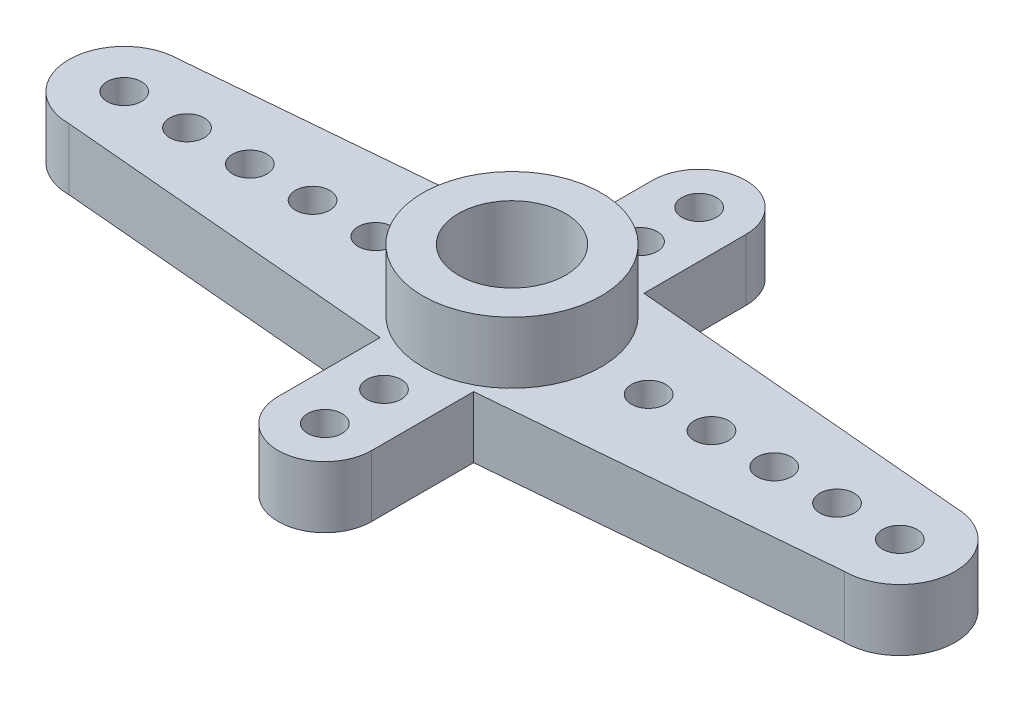
ISO-10303-21;
HEADER;
FILE_DESCRIPTION(('STEP AP214'),'2;1');
FILE_NAME('part.step','',(''),(''),'','','');
FILE_SCHEMA(('AUTOMOTIVE_DESIGN { 1 0 10303 214 1 1 1 1 }'));
ENDSEC;
DATA;
#1=APPLICATION_CONTEXT('core data for automotive mechanical design processes');
#2=APPLICATION_PROTOCOL_DEFINITION('international standard','automotive_design',2000,#1);
#3=PRODUCT_CONTEXT('',#1,'mechanical');
#4=PRODUCT('Part','Part','',(#3));
#5=PRODUCT_RELATED_PRODUCT_CATEGORY('part','',(#4));
#6=PRODUCT_DEFINITION_FORMATION('','',#4);
#7=PRODUCT_DEFINITION_CONTEXT('part definition',#1,'design');
#8=PRODUCT_DEFINITION('design','',#6,#7);
#9=PRODUCT_DEFINITION_SHAPE('','',#8);
#10=(LENGTH_UNIT() NAMED_UNIT(*) SI_UNIT(.MILLI.,.METRE.));
#11=(NAMED_UNIT(*) PLANE_ANGLE_UNIT() SI_UNIT($,.RADIAN.));
#12=(NAMED_UNIT(*) SI_UNIT($,.STERADIAN.) SOLID_ANGLE_UNIT());
#13=UNCERTAINTY_MEASURE_WITH_UNIT(LENGTH_MEASURE(1.E-05),#10,'distance_accuracy_value','');
#14=(GEOMETRIC_REPRESENTATION_CONTEXT(3) GLOBAL_UNCERTAINTY_ASSIGNED_CONTEXT((#13)) GLOBAL_UNIT_ASSIGNED_CONTEXT((#10,
#11,#12)) REPRESENTATION_CONTEXT('',''));
#15=CARTESIAN_POINT('',(0.,0.,0.));
#16=DIRECTION('',(0.,0.,1.));
#17=DIRECTION('',(1.,0.,0.));
#18=AXIS2_PLACEMENT_3D('',#15,#16,#17);
#19=CARTESIAN_POINT('',(18.,2.5,-7.6));
#20=DIRECTION('',(0.,1.,0.));
#21=DIRECTION('',(0.,0.,1.));
#22=AXIS2_PLACEMENT_3D('',#19,#20,#21);
#23=PLANE('',#22);
#24=CARTESIAN_POINT('',(18.,2.5,0.));
#25=DIRECTION('',(0.,1.,0.));
#26=DIRECTION('',(0.,0.,1.));
#27=AXIS2_PLACEMENT_3D('',#24,#25,#26);
#28=CIRCLE('',#27,3.625);
#29=CARTESIAN_POINT('',(18.,2.5,3.625));
#30=VERTEX_POINT('',#29);
#31=EDGE_CURVE('E360',#30,#30,#28,.T.);
#32=ORIENTED_EDGE('',*,*,#31,.F.);
#33=EDGE_LOOP('',(#32));
#34=FACE_BOUND('',#33,.T.);
#35=CARTESIAN_POINT('',(18.,2.5,-5.2));
#36=DIRECTION('',(0.,1.,0.));
#37=DIRECTION('',(0.,0.,1.));
#38=AXIS2_PLACEMENT_3D('',#35,#36,#37);
#39=CIRCLE('',#38,0.700000000000002);
#40=CARTESIAN_POINT('',(18.,2.5,-4.5));
#41=VERTEX_POINT('',#40);
#42=EDGE_CURVE('E374',#41,#41,#39,.T.);
#43=ORIENTED_EDGE('',*,*,#42,.F.);
#44=EDGE_LOOP('',(#43));
#45=FACE_BOUND('',#44,.T.);
#46=CARTESIAN_POINT('',(4.8,2.5,0.));
#47=DIRECTION('',(0.,1.,0.));
#48=DIRECTION('',(0.,0.,1.));
#49=AXIS2_PLACEMENT_3D('',#46,#47,#48);
#50=CIRCLE('',#49,0.7);
#51=CARTESIAN_POINT('',(4.8,2.5,0.7));
#52=VERTEX_POINT('',#51);
#53=EDGE_CURVE('E386',#52,#52,#50,.T.);
#54=ORIENTED_EDGE('',*,*,#53,.F.);
#55=EDGE_LOOP('',(#54));
#56=FACE_BOUND('',#55,.T.);
#57=CARTESIAN_POINT('',(9.9,2.5,0.));
#58=DIRECTION('',(0.,1.,0.));
#59=DIRECTION('',(0.,0.,1.));
#60=AXIS2_PLACEMENT_3D('',#57,#58,#59);
#61=CIRCLE('',#60,0.700000000000001);
#62=CARTESIAN_POINT('',(9.9,2.5,0.700000000000001));
#63=VERTEX_POINT('',#62);
#64=EDGE_CURVE('E398',#63,#63,#61,.T.);
#65=ORIENTED_EDGE('',*,*,#64,.F.);
#66=EDGE_LOOP('',(#65));
#67=FACE_BOUND('',#66,.T.);
#68=CARTESIAN_POINT('',(18.,2.5,5.2));
#69=DIRECTION('',(0.,1.,0.));
#70=DIRECTION('',(0.,0.,1.));
#71=AXIS2_PLACEMENT_3D('',#68,#69,#70);
#72=CIRCLE('',#71,0.700000000000002);
#73=CARTESIAN_POINT('',(18.,2.5,5.9));
#74=VERTEX_POINT('',#73);
#75=EDGE_CURVE('E410',#74,#74,#72,.T.);
#76=ORIENTED_EDGE('',*,*,#75,.F.);
#77=EDGE_LOOP('',(#76));
#78=FACE_BOUND('',#77,.T.);
#79=CARTESIAN_POINT('',(23.55,2.5,0.));
#80=DIRECTION('',(0.,1.,0.));
#81=DIRECTION('',(0.,0.,1.));
#82=AXIS2_PLACEMENT_3D('',#79,#80,#81);
#83=CIRCLE('',#82,0.700000000000002);
#84=CARTESIAN_POINT('',(23.55,2.5,0.700000000000002));
#85=VERTEX_POINT('',#84);
#86=EDGE_CURVE('E422',#85,#85,#83,.T.);
#87=ORIENTED_EDGE('',*,*,#86,.F.);
#88=EDGE_LOOP('',(#87));
#89=FACE_BOUND('',#88,.T.);
#90=CARTESIAN_POINT('',(28.65,2.5,0.));
#91=DIRECTION('',(0.,1.,0.));
#92=DIRECTION('',(0.,0.,1.));
#93=AXIS2_PLACEMENT_3D('',#90,#91,#92);
#94=CIRCLE('',#93,0.699999999999998);
#95=CARTESIAN_POINT('',(28.65,2.5,0.699999999999998));
#96=VERTEX_POINT('',#95);
#97=EDGE_CURVE('E434',#96,#96,#94,.T.);
#98=ORIENTED_EDGE('',*,*,#97,.F.);
#99=EDGE_LOOP('',(#98));
#100=FACE_BOUND('',#99,.T.);
#101=CARTESIAN_POINT('',(33.75,2.5,0.));
#102=DIRECTION('',(0.,1.,0.));
#103=DIRECTION('',(0.,0.,1.));
#104=AXIS2_PLACEMENT_3D('',#101,#102,#103);
#105=CIRCLE('',#104,0.700000000000001);
#106=CARTESIAN_POINT('',(33.75,2.5,0.700000000000001));
#107=VERTEX_POINT('',#106);
#108=EDGE_CURVE('E163',#107,#107,#105,.T.);
#109=ORIENTED_EDGE('',*,*,#108,.F.);
#110=EDGE_LOOP('',(#109));
#111=FACE_BOUND('',#110,.T.);
#112=CARTESIAN_POINT('',(18.,2.5,-7.6));
#113=DIRECTION('',(0.,1.,0.));
#114=DIRECTION('',(0.,0.,1.));
#115=AXIS2_PLACEMENT_3D('',#112,#113,#114);
#116=CIRCLE('',#115,1.9);
#117=CARTESIAN_POINT('',(19.9,2.5,-7.6));
#118=VERTEX_POINT('',#117);
#119=CARTESIAN_POINT('',(16.1,2.5,-7.6));
#120=VERTEX_POINT('',#119);
#121=EDGE_CURVE('E182',#118,#120,#116,.T.);
#122=ORIENTED_EDGE('',*,*,#121,.T.);
#123=DIRECTION('',(0.,0.,1.));
#124=VECTOR('',#123,1.);
#125=CARTESIAN_POINT('',(16.1,2.5,-7.6));
#126=LINE('',#125,#124);
#127=CARTESIAN_POINT('',(16.1,2.5,-3.45912698412698));
#128=VERTEX_POINT('',#127);
#129=EDGE_CURVE('E110',#120,#128,#126,.T.);
#130=ORIENTED_EDGE('',*,*,#129,.T.);
#131=DIRECTION('',(-0.996210862099652,0.,0.0869707895483823));
#132=VECTOR('',#131,1.);
#133=CARTESIAN_POINT('',(2.25,2.5,-2.25));
#134=LINE('',#133,#132);
#135=CARTESIAN_POINT('',(2.25,2.5,-2.25));
#136=VERTEX_POINT('',#135);
#137=EDGE_CURVE('E209',#128,#136,#134,.T.);
#138=ORIENTED_EDGE('',*,*,#137,.T.);
#139=CARTESIAN_POINT('',(2.25,2.5,0.));
#140=DIRECTION('',(0.,1.,0.));
#141=DIRECTION('',(0.,0.,1.));
#142=AXIS2_PLACEMENT_3D('',#139,#140,#141);
#143=CIRCLE('',#142,2.25);
#144=CARTESIAN_POINT('',(2.25,2.5,2.25));
#145=VERTEX_POINT('',#144);
#146=EDGE_CURVE('E228',#136,#145,#143,.T.);
#147=ORIENTED_EDGE('',*,*,#146,.T.);
#148=DIRECTION('',(0.996210862099651,0.,0.0869707895483823));
#149=VECTOR('',#148,1.);
#150=CARTESIAN_POINT('',(2.25,2.5,2.25));
#151=LINE('',#150,#149);
#152=CARTESIAN_POINT('',(16.1,2.5,3.45912698412698));
#153=VERTEX_POINT('',#152);
#154=EDGE_CURVE('E225',#145,#153,#151,.T.);
#155=ORIENTED_EDGE('',*,*,#154,.T.);
#156=DIRECTION('',(0.,0.,1.));
#157=VECTOR('',#156,1.);
#158=CARTESIAN_POINT('',(16.1,2.5,7.6));
#159=LINE('',#158,#157);
#160=CARTESIAN_POINT('',(16.1,2.5,7.6));
#161=VERTEX_POINT('',#160);
#162=EDGE_CURVE('E227',#153,#161,#159,.T.);
#163=ORIENTED_EDGE('',*,*,#162,.T.);
#164=CARTESIAN_POINT('',(18.,2.5,7.6));
#165=DIRECTION('',(0.,1.,0.));
#166=DIRECTION('',(0.,0.,1.));
#167=AXIS2_PLACEMENT_3D('',#164,#165,#166);
#168=CIRCLE('',#167,1.9);
#169=CARTESIAN_POINT('',(19.9,2.5,7.6));
#170=VERTEX_POINT('',#169);
#171=EDGE_CURVE('E230',#161,#170,#168,.T.);
#172=ORIENTED_EDGE('',*,*,#171,.T.);
#173=DIRECTION('',(0.,0.,-1.));
#174=VECTOR('',#173,1.);
#175=CARTESIAN_POINT('',(19.9,2.5,7.6));
#176=LINE('',#175,#174);
#177=CARTESIAN_POINT('',(19.9,2.5,3.45912698412698));
#178=VERTEX_POINT('',#177);
#179=EDGE_CURVE('E236',#170,#178,#176,.T.);
#180=ORIENTED_EDGE('',*,*,#179,.T.);
#181=DIRECTION('',(0.996210862099652,0.,-0.0869707895483824));
#182=VECTOR('',#181,1.);
#183=CARTESIAN_POINT('',(33.75,2.5,2.25));
#184=LINE('',#183,#182);
#185=CARTESIAN_POINT('',(33.75,2.5,2.25));
#186=VERTEX_POINT('',#185);
#187=EDGE_CURVE('E141',#178,#186,#184,.T.);
#188=ORIENTED_EDGE('',*,*,#187,.T.);
#189=CARTESIAN_POINT('',(33.75,2.5,0.));
#190=DIRECTION('',(0.,1.,0.));
#191=DIRECTION('',(0.,0.,1.));
#192=AXIS2_PLACEMENT_3D('',#189,#190,#191);
#193=CIRCLE('',#192,2.25);
#194=CARTESIAN_POINT('',(33.75,2.5,-2.25));
#195=VERTEX_POINT('',#194);
#196=EDGE_CURVE('E135',#186,#195,#193,.T.);
#197=ORIENTED_EDGE('',*,*,#196,.T.);
#198=DIRECTION('',(-0.996210862099652,0.,-0.0869707895483824));
#199=VECTOR('',#198,1.);
#200=CARTESIAN_POINT('',(33.75,2.5,-2.25));
#201=LINE('',#200,#199);
#202=CARTESIAN_POINT('',(19.9,2.5,-3.45912698412698));
#203=VERTEX_POINT('',#202);
#204=EDGE_CURVE('E139',#195,#203,#201,.T.);
#205=ORIENTED_EDGE('',*,*,#204,.T.);
#206=DIRECTION('',(0.,0.,-1.));
#207=VECTOR('',#206,1.);
#208=CARTESIAN_POINT('',(19.9,2.5,-7.6));
#209=LINE('',#208,#207);
#210=EDGE_CURVE('E55',#203,#118,#209,.T.);
#211=ORIENTED_EDGE('',*,*,#210,.T.);
#212=EDGE_LOOP('',(#122,#130,#138,#147,#155,#163,#172,#180,#188,#197,#205,#211));
#213=FACE_BOUND('',#212,.T.);
#214=CARTESIAN_POINT('',(31.2,2.5,0.));
#215=DIRECTION('',(0.,1.,0.));
#216=DIRECTION('',(0.,0.,1.));
#217=AXIS2_PLACEMENT_3D('',#214,#215,#216);
#218=CIRCLE('',#217,0.700000000000002);
#219=CARTESIAN_POINT('',(31.2,2.5,0.700000000000002));
#220=VERTEX_POINT('',#219);
#221=EDGE_CURVE('E440',#220,#220,#218,.T.);
#222=ORIENTED_EDGE('',*,*,#221,.F.);
#223=EDGE_LOOP('',(#222));
#224=FACE_BOUND('',#223,.T.);
#225=CARTESIAN_POINT('',(26.1,2.5,0.));
#226=DIRECTION('',(0.,1.,0.));
#227=DIRECTION('',(0.,0.,1.));
#228=AXIS2_PLACEMENT_3D('',#225,#226,#227);
#229=CIRCLE('',#228,0.700000000000002);
#230=CARTESIAN_POINT('',(26.1,2.5,0.700000000000002));
#231=VERTEX_POINT('',#230);
#232=EDGE_CURVE('E428',#231,#231,#229,.T.);
#233=ORIENTED_EDGE('',*,*,#232,.F.);
#234=EDGE_LOOP('',(#233));
#235=FACE_BOUND('',#234,.T.);
#236=CARTESIAN_POINT('',(18.,2.5,7.6));
#237=DIRECTION('',(0.,1.,0.));
#238=DIRECTION('',(0.,0.,1.));
#239=AXIS2_PLACEMENT_3D('',#236,#237,#238);
#240=CIRCLE('',#239,0.699999999999998);
#241=CARTESIAN_POINT('',(18.,2.5,8.3));
#242=VERTEX_POINT('',#241);
#243=EDGE_CURVE('E416',#242,#242,#240,.T.);
#244=ORIENTED_EDGE('',*,*,#243,.F.);
#245=EDGE_LOOP('',(#244));
#246=FACE_BOUND('',#245,.T.);
#247=CARTESIAN_POINT('',(12.45,2.5,0.));
#248=DIRECTION('',(0.,1.,0.));
#249=DIRECTION('',(0.,0.,1.));
#250=AXIS2_PLACEMENT_3D('',#247,#248,#249);
#251=CIRCLE('',#250,0.700000000000001);
#252=CARTESIAN_POINT('',(12.45,2.5,0.700000000000002));
#253=VERTEX_POINT('',#252);
#254=EDGE_CURVE('E404',#253,#253,#251,.T.);
#255=ORIENTED_EDGE('',*,*,#254,.F.);
#256=EDGE_LOOP('',(#255));
#257=FACE_BOUND('',#256,.T.);
#258=CARTESIAN_POINT('',(7.35,2.5,0.));
#259=DIRECTION('',(0.,1.,0.));
#260=DIRECTION('',(0.,0.,1.));
#261=AXIS2_PLACEMENT_3D('',#258,#259,#260);
#262=CIRCLE('',#261,0.7);
#263=CARTESIAN_POINT('',(7.35,2.5,0.7));
#264=VERTEX_POINT('',#263);
#265=EDGE_CURVE('E392',#264,#264,#262,.T.);
#266=ORIENTED_EDGE('',*,*,#265,.F.);
#267=EDGE_LOOP('',(#266));
#268=FACE_BOUND('',#267,.T.);
#269=CARTESIAN_POINT('',(2.25,2.5,0.));
#270=DIRECTION('',(0.,1.,0.));
#271=DIRECTION('',(0.,0.,1.));
#272=AXIS2_PLACEMENT_3D('',#269,#270,#271);
#273=CIRCLE('',#272,0.700000000000001);
#274=CARTESIAN_POINT('',(2.25,2.5,0.700000000000001));
#275=VERTEX_POINT('',#274);
#276=EDGE_CURVE('E380',#275,#275,#273,.T.);
#277=ORIENTED_EDGE('',*,*,#276,.F.);
#278=EDGE_LOOP('',(#277));
#279=FACE_BOUND('',#278,.T.);
#280=CARTESIAN_POINT('',(18.,2.5,-7.6));
#281=DIRECTION('',(0.,1.,0.));
#282=DIRECTION('',(0.,0.,1.));
#283=AXIS2_PLACEMENT_3D('',#280,#281,#282);
#284=CIRCLE('',#283,0.699999999999998);
#285=CARTESIAN_POINT('',(18.,2.5,-6.9));
#286=VERTEX_POINT('',#285);
#287=EDGE_CURVE('E368',#286,#286,#284,.T.);
#288=ORIENTED_EDGE('',*,*,#287,.F.);
#289=EDGE_LOOP('',(#288));
#290=FACE_BOUND('',#289,.T.);
#291=ADVANCED_FACE('F38',(#34,#45,#56,#67,#78,#89,#100,#111,#213,#224,#235,#246,#257,#268,#279,
#290),#23,.T.);
#292=CARTESIAN_POINT('',(18.,0.,-7.6));
#293=DIRECTION('',(0.,1.,0.));
#294=DIRECTION('',(0.,0.,1.));
#295=AXIS2_PLACEMENT_3D('',#292,#293,#294);
#296=PLANE('',#295);
#297=CARTESIAN_POINT('',(18.,0.,0.));
#298=DIRECTION('',(0.,1.,0.));
#299=DIRECTION('',(0.,0.,1.));
#300=AXIS2_PLACEMENT_3D('',#297,#298,#299);
#301=CIRCLE('',#300,1.25);
#302=CARTESIAN_POINT('',(18.,0.,1.25));
#303=VERTEX_POINT('',#302);
#304=EDGE_CURVE('E351',#303,#303,#301,.F.);
#305=ORIENTED_EDGE('',*,*,#304,.F.);
#306=EDGE_LOOP('',(#305));
#307=FACE_BOUND('',#306,.T.);
#308=CARTESIAN_POINT('',(18.,0.,-7.6));
#309=DIRECTION('',(0.,1.,0.));
#310=DIRECTION('',(0.,0.,1.));
#311=AXIS2_PLACEMENT_3D('',#308,#309,#310);
#312=CIRCLE('',#311,1.9);
#313=CARTESIAN_POINT('',(19.9,0.,-7.6));
#314=VERTEX_POINT('',#313);
#315=CARTESIAN_POINT('',(16.1,0.,-7.6));
#316=VERTEX_POINT('',#315);
#317=EDGE_CURVE('E159',#314,#316,#312,.T.);
#318=ORIENTED_EDGE('',*,*,#317,.F.);
#319=DIRECTION('',(0.,0.,-1.));
#320=VECTOR('',#319,1.);
#321=CARTESIAN_POINT('',(19.9,0.,-7.6));
#322=LINE('',#321,#320);
#323=CARTESIAN_POINT('',(19.9,0.,-3.45912698412698));
#324=VERTEX_POINT('',#323);
#325=EDGE_CURVE('E102',#324,#314,#322,.T.);
#326=ORIENTED_EDGE('',*,*,#325,.F.);
#327=DIRECTION('',(-0.996210862099652,0.,-0.0869707895483824));
#328=VECTOR('',#327,1.);
#329=CARTESIAN_POINT('',(33.75,0.,-2.25));
#330=LINE('',#329,#328);
#331=CARTESIAN_POINT('',(33.75,0.,-2.25));
#332=VERTEX_POINT('',#331);
#333=EDGE_CURVE('E96',#332,#324,#330,.T.);
#334=ORIENTED_EDGE('',*,*,#333,.F.);
#335=CARTESIAN_POINT('',(33.75,0.,0.));
#336=DIRECTION('',(0.,1.,0.));
#337=DIRECTION('',(0.,0.,1.));
#338=AXIS2_PLACEMENT_3D('',#335,#336,#337);
#339=CIRCLE('',#338,2.25);
#340=CARTESIAN_POINT('',(33.75,0.,2.25));
#341=VERTEX_POINT('',#340);
#342=EDGE_CURVE('E149',#341,#332,#339,.T.);
#343=ORIENTED_EDGE('',*,*,#342,.F.);
#344=DIRECTION('',(0.996210862099652,0.,-0.0869707895483824));
#345=VECTOR('',#344,1.);
#346=CARTESIAN_POINT('',(33.75,0.,2.25));
#347=LINE('',#346,#345);
#348=CARTESIAN_POINT('',(19.9,0.,3.45912698412698));
#349=VERTEX_POINT('',#348);
#350=EDGE_CURVE('E177',#349,#341,#347,.T.);
#351=ORIENTED_EDGE('',*,*,#350,.F.);
#352=DIRECTION('',(0.,0.,-1.));
#353=VECTOR('',#352,1.);
#354=CARTESIAN_POINT('',(19.9,0.,7.6));
#355=LINE('',#354,#353);
#356=CARTESIAN_POINT('',(19.9,0.,7.6));
#357=VERTEX_POINT('',#356);
#358=EDGE_CURVE('E175',#357,#349,#355,.T.);
#359=ORIENTED_EDGE('',*,*,#358,.F.);
#360=CARTESIAN_POINT('',(18.,0.,7.6));
#361=DIRECTION('',(0.,1.,0.));
#362=DIRECTION('',(0.,0.,1.));
#363=AXIS2_PLACEMENT_3D('',#360,#361,#362);
#364=CIRCLE('',#363,1.9);
#365=CARTESIAN_POINT('',(16.1,0.,7.6));
#366=VERTEX_POINT('',#365);
#367=EDGE_CURVE('E173',#366,#357,#364,.T.);
#368=ORIENTED_EDGE('',*,*,#367,.F.);
#369=DIRECTION('',(0.,0.,1.));
#370=VECTOR('',#369,1.);
#371=CARTESIAN_POINT('',(16.1,0.,7.6));
#372=LINE('',#371,#370);
#373=CARTESIAN_POINT('',(16.1,0.,3.45912698412698));
#374=VERTEX_POINT('',#373);
#375=EDGE_CURVE('E171',#374,#366,#372,.T.);
#376=ORIENTED_EDGE('',*,*,#375,.F.);
#377=DIRECTION('',(0.996210862099651,0.,0.0869707895483823));
#378=VECTOR('',#377,1.);
#379=CARTESIAN_POINT('',(2.25,0.,2.25));
#380=LINE('',#379,#378);
#381=CARTESIAN_POINT('',(2.25,0.,2.25));
#382=VERTEX_POINT('',#381);
#383=EDGE_CURVE('E169',#382,#374,#380,.T.);
#384=ORIENTED_EDGE('',*,*,#383,.F.);
#385=CARTESIAN_POINT('',(2.25,0.,0.));
#386=DIRECTION('',(0.,1.,0.));
#387=DIRECTION('',(0.,0.,1.));
#388=AXIS2_PLACEMENT_3D('',#385,#386,#387);
#389=CIRCLE('',#388,2.25);
#390=CARTESIAN_POINT('',(2.25,0.,-2.25));
#391=VERTEX_POINT('',#390);
#392=EDGE_CURVE('E167',#391,#382,#389,.T.);
#393=ORIENTED_EDGE('',*,*,#392,.F.);
#394=DIRECTION('',(-0.996210862099652,0.,0.0869707895483823));
#395=VECTOR('',#394,1.);
#396=CARTESIAN_POINT('',(2.25,0.,-2.25));
#397=LINE('',#396,#395);
#398=CARTESIAN_POINT('',(16.1,0.,-3.45912698412698));
#399=VERTEX_POINT('',#398);
#400=EDGE_CURVE('E165',#399,#391,#397,.T.);
#401=ORIENTED_EDGE('',*,*,#400,.F.);
#402=DIRECTION('',(0.,0.,1.));
#403=VECTOR('',#402,1.);
#404=CARTESIAN_POINT('',(16.1,0.,-7.6));
#405=LINE('',#404,#403);
#406=EDGE_CURVE('E162',#316,#399,#405,.T.);
#407=ORIENTED_EDGE('',*,*,#406,.F.);
#408=EDGE_LOOP('',(#318,#326,#334,#343,#351,#359,#368,#376,#384,#393,#401,#407));
#409=FACE_BOUND('',#408,.T.);
#410=CARTESIAN_POINT('',(33.75,0.,0.));
#411=DIRECTION('',(0.,1.,0.));
#412=DIRECTION('',(0.,0.,1.));
#413=AXIS2_PLACEMENT_3D('',#410,#411,#412);
#414=CIRCLE('',#413,0.700000000000001);
#415=CARTESIAN_POINT('',(33.75,0.,0.700000000000001));
#416=VERTEX_POINT('',#415);
#417=EDGE_CURVE('E443',#416,#416,#414,.T.);
#418=ORIENTED_EDGE('',*,*,#417,.T.);
#419=EDGE_LOOP('',(#418));
#420=FACE_BOUND('',#419,.T.);
#421=CARTESIAN_POINT('',(31.2,0.,0.));
#422=DIRECTION('',(0.,1.,0.));
#423=DIRECTION('',(0.,0.,1.));
#424=AXIS2_PLACEMENT_3D('',#421,#422,#423);
#425=CIRCLE('',#424,0.700000000000002);
#426=CARTESIAN_POINT('',(31.2,0.,0.700000000000002));
#427=VERTEX_POINT('',#426);
#428=EDGE_CURVE('E437',#427,#427,#425,.T.);
#429=ORIENTED_EDGE('',*,*,#428,.T.);
#430=EDGE_LOOP('',(#429));
#431=FACE_BOUND('',#430,.T.);
#432=CARTESIAN_POINT('',(28.65,0.,0.));
#433=DIRECTION('',(0.,1.,0.));
#434=DIRECTION('',(0.,0.,1.));
#435=AXIS2_PLACEMENT_3D('',#432,#433,#434);
#436=CIRCLE('',#435,0.699999999999998);
#437=CARTESIAN_POINT('',(28.65,0.,0.699999999999998));
#438=VERTEX_POINT('',#437);
#439=EDGE_CURVE('E431',#438,#438,#436,.T.);
#440=ORIENTED_EDGE('',*,*,#439,.T.);
#441=EDGE_LOOP('',(#440));
#442=FACE_BOUND('',#441,.T.);
#443=CARTESIAN_POINT('',(26.1,0.,0.));
#444=DIRECTION('',(0.,1.,0.));
#445=DIRECTION('',(0.,0.,1.));
#446=AXIS2_PLACEMENT_3D('',#443,#444,#445);
#447=CIRCLE('',#446,0.700000000000002);
#448=CARTESIAN_POINT('',(26.1,0.,0.700000000000002));
#449=VERTEX_POINT('',#448);
#450=EDGE_CURVE('E425',#449,#449,#447,.T.);
#451=ORIENTED_EDGE('',*,*,#450,.T.);
#452=EDGE_LOOP('',(#451));
#453=FACE_BOUND('',#452,.T.);
#454=CARTESIAN_POINT('',(23.55,0.,0.));
#455=DIRECTION('',(0.,1.,0.));
#456=DIRECTION('',(0.,0.,1.));
#457=AXIS2_PLACEMENT_3D('',#454,#455,#456);
#458=CIRCLE('',#457,0.700000000000002);
#459=CARTESIAN_POINT('',(23.55,0.,0.700000000000002));
#460=VERTEX_POINT('',#459);
#461=EDGE_CURVE('E419',#460,#460,#458,.T.);
#462=ORIENTED_EDGE('',*,*,#461,.T.);
#463=EDGE_LOOP('',(#462));
#464=FACE_BOUND('',#463,.T.);
#465=CARTESIAN_POINT('',(18.,0.,7.6));
#466=DIRECTION('',(0.,1.,0.));
#467=DIRECTION('',(0.,0.,1.));
#468=AXIS2_PLACEMENT_3D('',#465,#466,#467);
#469=CIRCLE('',#468,0.699999999999998);
#470=CARTESIAN_POINT('',(18.,0.,8.3));
#471=VERTEX_POINT('',#470);
#472=EDGE_CURVE('E413',#471,#471,#469,.T.);
#473=ORIENTED_EDGE('',*,*,#472,.T.);
#474=EDGE_LOOP('',(#473));
#475=FACE_BOUND('',#474,.T.);
#476=CARTESIAN_POINT('',(18.,0.,5.2));
#477=DIRECTION('',(0.,1.,0.));
#478=DIRECTION('',(0.,0.,1.));
#479=AXIS2_PLACEMENT_3D('',#476,#477,#478);
#480=CIRCLE('',#479,0.700000000000002);
#481=CARTESIAN_POINT('',(18.,0.,5.9));
#482=VERTEX_POINT('',#481);
#483=EDGE_CURVE('E407',#482,#482,#480,.T.);
#484=ORIENTED_EDGE('',*,*,#483,.T.);
#485=EDGE_LOOP('',(#484));
#486=FACE_BOUND('',#485,.T.);
#487=CARTESIAN_POINT('',(12.45,0.,0.));
#488=DIRECTION('',(0.,1.,0.));
#489=DIRECTION('',(0.,0.,1.));
#490=AXIS2_PLACEMENT_3D('',#487,#488,#489);
#491=CIRCLE('',#490,0.700000000000001);
#492=CARTESIAN_POINT('',(12.45,0.,0.700000000000002));
#493=VERTEX_POINT('',#492);
#494=EDGE_CURVE('E401',#493,#493,#491,.T.);
#495=ORIENTED_EDGE('',*,*,#494,.T.);
#496=EDGE_LOOP('',(#495));
#497=FACE_BOUND('',#496,.T.);
#498=CARTESIAN_POINT('',(9.9,0.,0.));
#499=DIRECTION('',(0.,1.,0.));
#500=DIRECTION('',(0.,0.,1.));
#501=AXIS2_PLACEMENT_3D('',#498,#499,#500);
#502=CIRCLE('',#501,0.700000000000001);
#503=CARTESIAN_POINT('',(9.9,0.,0.700000000000001));
#504=VERTEX_POINT('',#503);
#505=EDGE_CURVE('E395',#504,#504,#502,.T.);
#506=ORIENTED_EDGE('',*,*,#505,.T.);
#507=EDGE_LOOP('',(#506));
#508=FACE_BOUND('',#507,.T.);
#509=CARTESIAN_POINT('',(7.35,0.,0.));
#510=DIRECTION('',(0.,1.,0.));
#511=DIRECTION('',(0.,0.,1.));
#512=AXIS2_PLACEMENT_3D('',#509,#510,#511);
#513=CIRCLE('',#512,0.7);
#514=CARTESIAN_POINT('',(7.35,0.,0.7));
#515=VERTEX_POINT('',#514);
#516=EDGE_CURVE('E389',#515,#515,#513,.T.);
#517=ORIENTED_EDGE('',*,*,#516,.T.);
#518=EDGE_LOOP('',(#517));
#519=FACE_BOUND('',#518,.T.);
#520=CARTESIAN_POINT('',(4.8,0.,0.));
#521=DIRECTION('',(0.,1.,0.));
#522=DIRECTION('',(0.,0.,1.));
#523=AXIS2_PLACEMENT_3D('',#520,#521,#522);
#524=CIRCLE('',#523,0.7);
#525=CARTESIAN_POINT('',(4.8,0.,0.7));
#526=VERTEX_POINT('',#525);
#527=EDGE_CURVE('E383',#526,#526,#524,.T.);
#528=ORIENTED_EDGE('',*,*,#527,.T.);
#529=EDGE_LOOP('',(#528));
#530=FACE_BOUND('',#529,.T.);
#531=CARTESIAN_POINT('',(2.25,0.,0.));
#532=DIRECTION('',(0.,1.,0.));
#533=DIRECTION('',(0.,0.,1.));
#534=AXIS2_PLACEMENT_3D('',#531,#532,#533);
#535=CIRCLE('',#534,0.700000000000001);
#536=CARTESIAN_POINT('',(2.25,0.,0.700000000000001));
#537=VERTEX_POINT('',#536);
#538=EDGE_CURVE('E377',#537,#537,#535,.T.);
#539=ORIENTED_EDGE('',*,*,#538,.T.);
#540=EDGE_LOOP('',(#539));
#541=FACE_BOUND('',#540,.T.);
#542=CARTESIAN_POINT('',(18.,0.,-5.2));
#543=DIRECTION('',(0.,1.,0.));
#544=DIRECTION('',(0.,0.,1.));
#545=AXIS2_PLACEMENT_3D('',#542,#543,#544);
#546=CIRCLE('',#545,0.700000000000002);
#547=CARTESIAN_POINT('',(18.,0.,-4.5));
#548=VERTEX_POINT('',#547);
#549=EDGE_CURVE('E371',#548,#548,#546,.T.);
#550=ORIENTED_EDGE('',*,*,#549,.T.);
#551=EDGE_LOOP('',(#550));
#552=FACE_BOUND('',#551,.T.);
#553=CARTESIAN_POINT('',(18.,0.,-7.6));
#554=DIRECTION('',(0.,1.,0.));
#555=DIRECTION('',(0.,0.,1.));
#556=AXIS2_PLACEMENT_3D('',#553,#554,#555);
#557=CIRCLE('',#556,0.699999999999998);
#558=CARTESIAN_POINT('',(18.,0.,-6.9));
#559=VERTEX_POINT('',#558);
#560=EDGE_CURVE('E365',#559,#559,#557,.T.);
#561=ORIENTED_EDGE('',*,*,#560,.T.);
#562=EDGE_LOOP('',(#561));
#563=FACE_BOUND('',#562,.T.);
#564=ADVANCED_FACE('F213',(#307,#409,#420,#431,#442,#453,#464,#475,#486,#497,#508,#519,#530,
#541,#552,#563),#296,.F.);
#565=CARTESIAN_POINT('',(18.,2.5,-7.6));
#566=DIRECTION('',(0.,-1.,0.));
#567=DIRECTION('',(0.,0.,-1.));
#568=AXIS2_PLACEMENT_3D('',#565,#566,#567);
#569=CYLINDRICAL_SURFACE('',#568,1.9);
#570=ORIENTED_EDGE('',*,*,#317,.T.);
#571=DIRECTION('',(0.,-1.,0.));
#572=VECTOR('',#571,1.);
#573=CARTESIAN_POINT('',(16.1,2.5,-7.6));
#574=LINE('',#573,#572);
#575=EDGE_CURVE('E11',#120,#316,#574,.T.);
#576=ORIENTED_EDGE('',*,*,#575,.F.);
#577=ORIENTED_EDGE('',*,*,#121,.F.);
#578=DIRECTION('',(0.,-1.,0.));
#579=VECTOR('',#578,1.);
#580=CARTESIAN_POINT('',(19.9,2.5,-7.6));
#581=LINE('',#580,#579);
#582=EDGE_CURVE('E155',#118,#314,#581,.T.);
#583=ORIENTED_EDGE('',*,*,#582,.T.);
#584=EDGE_LOOP('',(#570,#576,#577,#583));
#585=FACE_BOUND('',#584,.T.);
#586=ADVANCED_FACE('F40',(#585),#569,.T.);
#587=CARTESIAN_POINT('',(16.1,2.5,-7.6));
#588=DIRECTION('',(1.,0.,0.));
#589=DIRECTION('',(0.,0.,-1.));
#590=AXIS2_PLACEMENT_3D('',#587,#588,#589);
#591=PLANE('',#590);
#592=ORIENTED_EDGE('',*,*,#406,.T.);
#593=DIRECTION('',(0.,-1.,0.));
#594=VECTOR('',#593,1.);
#595=CARTESIAN_POINT('',(16.1,2.5,-3.45912698412698));
#596=LINE('',#595,#594);
#597=EDGE_CURVE('E47',#128,#399,#596,.T.);
#598=ORIENTED_EDGE('',*,*,#597,.F.);
#599=ORIENTED_EDGE('',*,*,#129,.F.);
#600=ORIENTED_EDGE('',*,*,#575,.T.);
#601=EDGE_LOOP('',(#592,#598,#599,#600));
#602=FACE_BOUND('',#601,.T.);
#603=ADVANCED_FACE('F677',(#602),#591,.F.);
#604=CARTESIAN_POINT('',(2.25,2.5,-2.25));
#605=DIRECTION('',(0.0869707895483823,0.,0.996210862099651));
#606=DIRECTION('',(0.996210862099652,0.,-0.0869707895483823));
#607=AXIS2_PLACEMENT_3D('',#604,#605,#606);
#608=PLANE('',#607);
#609=ORIENTED_EDGE('',*,*,#400,.T.);
#610=DIRECTION('',(0.,-1.,0.));
#611=VECTOR('',#610,1.);
#612=CARTESIAN_POINT('',(2.25,2.5,-2.25));
#613=LINE('',#612,#611);
#614=EDGE_CURVE('E201',#136,#391,#613,.T.);
#615=ORIENTED_EDGE('',*,*,#614,.F.);
#616=ORIENTED_EDGE('',*,*,#137,.F.);
#617=ORIENTED_EDGE('',*,*,#597,.T.);
#618=EDGE_LOOP('',(#609,#615,#616,#617));
#619=FACE_BOUND('',#618,.T.);
#620=ADVANCED_FACE('F207',(#619),#608,.F.);
#621=CARTESIAN_POINT('',(2.25,2.5,0.));
#622=DIRECTION('',(0.,-1.,0.));
#623=DIRECTION('',(0.,0.,-1.));
#624=AXIS2_PLACEMENT_3D('',#621,#622,#623);
#625=CYLINDRICAL_SURFACE('',#624,2.25);
#626=ORIENTED_EDGE('',*,*,#392,.T.);
#627=DIRECTION('',(0.,-1.,0.));
#628=VECTOR('',#627,1.);
#629=CARTESIAN_POINT('',(2.25,2.5,2.25));
#630=LINE('',#629,#628);
#631=EDGE_CURVE('E198',#145,#382,#630,.T.);
#632=ORIENTED_EDGE('',*,*,#631,.F.);
#633=ORIENTED_EDGE('',*,*,#146,.F.);
#634=ORIENTED_EDGE('',*,*,#614,.T.);
#635=EDGE_LOOP('',(#626,#632,#633,#634));
#636=FACE_BOUND('',#635,.T.);
#637=ADVANCED_FACE('F219',(#636),#625,.T.);
#638=CARTESIAN_POINT('',(2.25,2.5,2.25));
#639=DIRECTION('',(0.0869707895483823,0.,-0.996210862099651));
#640=DIRECTION('',(-0.996210862099652,0.,-0.0869707895483823));
#641=AXIS2_PLACEMENT_3D('',#638,#639,#640);
#642=PLANE('',#641);
#643=ORIENTED_EDGE('',*,*,#383,.T.);
#644=DIRECTION('',(0.,-1.,0.));
#645=VECTOR('',#644,1.);
#646=CARTESIAN_POINT('',(16.1,2.5,3.45912698412698));
#647=LINE('',#646,#645);
#648=EDGE_CURVE('E195',#153,#374,#647,.T.);
#649=ORIENTED_EDGE('',*,*,#648,.F.);
#650=ORIENTED_EDGE('',*,*,#154,.F.);
#651=ORIENTED_EDGE('',*,*,#631,.T.);
#652=EDGE_LOOP('',(#643,#649,#650,#651));
#653=FACE_BOUND('',#652,.T.);
#654=ADVANCED_FACE('F223',(#653),#642,.F.);
#655=CARTESIAN_POINT('',(16.1,2.5,7.6));
#656=DIRECTION('',(1.,0.,0.));
#657=DIRECTION('',(0.,0.,-1.));
#658=AXIS2_PLACEMENT_3D('',#655,#656,#657);
#659=PLANE('',#658);
#660=ORIENTED_EDGE('',*,*,#375,.T.);
#661=DIRECTION('',(0.,-1.,0.));
#662=VECTOR('',#661,1.);
#663=CARTESIAN_POINT('',(16.1,2.5,7.6));
#664=LINE('',#663,#662);
#665=EDGE_CURVE('E192',#161,#366,#664,.T.);
#666=ORIENTED_EDGE('',*,*,#665,.F.);
#667=ORIENTED_EDGE('',*,*,#162,.F.);
#668=ORIENTED_EDGE('',*,*,#648,.T.);
#669=EDGE_LOOP('',(#660,#666,#667,#668));
#670=FACE_BOUND('',#669,.T.);
#671=ADVANCED_FACE('F642',(#670),#659,.F.);
#672=CARTESIAN_POINT('',(18.,2.5,7.6));
#673=DIRECTION('',(0.,-1.,0.));
#674=DIRECTION('',(0.,0.,-1.));
#675=AXIS2_PLACEMENT_3D('',#672,#673,#674);
#676=CYLINDRICAL_SURFACE('',#675,1.9);
#677=ORIENTED_EDGE('',*,*,#367,.T.);
#678=DIRECTION('',(0.,-1.,0.));
#679=VECTOR('',#678,1.);
#680=CARTESIAN_POINT('',(19.9,2.5,7.6));
#681=LINE('',#680,#679);
#682=EDGE_CURVE('E189',#170,#357,#681,.T.);
#683=ORIENTED_EDGE('',*,*,#682,.F.);
#684=ORIENTED_EDGE('',*,*,#171,.F.);
#685=ORIENTED_EDGE('',*,*,#665,.T.);
#686=EDGE_LOOP('',(#677,#683,#684,#685));
#687=FACE_BOUND('',#686,.T.);
#688=ADVANCED_FACE('F633',(#687),#676,.T.);
#689=CARTESIAN_POINT('',(19.9,2.5,7.6));
#690=DIRECTION('',(-1.,0.,0.));
#691=DIRECTION('',(0.,0.,1.));
#692=AXIS2_PLACEMENT_3D('',#689,#690,#691);
#693=PLANE('',#692);
#694=ORIENTED_EDGE('',*,*,#358,.T.);
#695=DIRECTION('',(0.,-1.,0.));
#696=VECTOR('',#695,1.);
#697=CARTESIAN_POINT('',(19.9,2.5,3.45912698412698));
#698=LINE('',#697,#696);
#699=EDGE_CURVE('E186',#178,#349,#698,.T.);
#700=ORIENTED_EDGE('',*,*,#699,.F.);
#701=ORIENTED_EDGE('',*,*,#179,.F.);
#702=ORIENTED_EDGE('',*,*,#682,.T.);
#703=EDGE_LOOP('',(#694,#700,#701,#702));
#704=FACE_BOUND('',#703,.T.);
#705=ADVANCED_FACE('F242',(#704),#693,.F.);
#706=CARTESIAN_POINT('',(33.75,2.5,2.25));
#707=DIRECTION('',(-0.0869707895483824,0.,-0.996210862099651));
#708=DIRECTION('',(-0.996210862099652,0.,0.0869707895483824));
#709=AXIS2_PLACEMENT_3D('',#706,#707,#708);
#710=PLANE('',#709);
#711=ORIENTED_EDGE('',*,*,#350,.T.);
#712=DIRECTION('',(0.,-1.,0.));
#713=VECTOR('',#712,1.);
#714=CARTESIAN_POINT('',(33.75,2.5,2.25));
#715=LINE('',#714,#713);
#716=EDGE_CURVE('E150',#186,#341,#715,.T.);
#717=ORIENTED_EDGE('',*,*,#716,.F.);
#718=ORIENTED_EDGE('',*,*,#187,.F.);
#719=ORIENTED_EDGE('',*,*,#699,.T.);
#720=EDGE_LOOP('',(#711,#717,#718,#719));
#721=FACE_BOUND('',#720,.T.);
#722=ADVANCED_FACE('F246',(#721),#710,.F.);
#723=CARTESIAN_POINT('',(33.75,2.5,0.));
#724=DIRECTION('',(0.,-1.,0.));
#725=DIRECTION('',(0.,0.,-1.));
#726=AXIS2_PLACEMENT_3D('',#723,#724,#725);
#727=CYLINDRICAL_SURFACE('',#726,2.25);
#728=ORIENTED_EDGE('',*,*,#342,.T.);
#729=DIRECTION('',(0.,-1.,0.));
#730=VECTOR('',#729,1.);
#731=CARTESIAN_POINT('',(33.75,2.5,-2.25));
#732=LINE('',#731,#730);
#733=EDGE_CURVE('E146',#195,#332,#732,.T.);
#734=ORIENTED_EDGE('',*,*,#733,.F.);
#735=ORIENTED_EDGE('',*,*,#196,.F.);
#736=ORIENTED_EDGE('',*,*,#716,.T.);
#737=EDGE_LOOP('',(#728,#734,#735,#736));
#738=FACE_BOUND('',#737,.T.);
#739=ADVANCED_FACE('F147',(#738),#727,.T.);
#740=CARTESIAN_POINT('',(33.75,2.5,-2.25));
#741=DIRECTION('',(-0.0869707895483824,0.,0.996210862099651));
#742=DIRECTION('',(0.996210862099652,0.,0.0869707895483824));
#743=AXIS2_PLACEMENT_3D('',#740,#741,#742);
#744=PLANE('',#743);
#745=ORIENTED_EDGE('',*,*,#333,.T.);
#746=DIRECTION('',(0.,-1.,0.));
#747=VECTOR('',#746,1.);
#748=CARTESIAN_POINT('',(19.9,2.5,-3.45912698412698));
#749=LINE('',#748,#747);
#750=EDGE_CURVE('E151',#203,#324,#749,.T.);
#751=ORIENTED_EDGE('',*,*,#750,.F.);
#752=ORIENTED_EDGE('',*,*,#204,.F.);
#753=ORIENTED_EDGE('',*,*,#733,.T.);
#754=EDGE_LOOP('',(#745,#751,#752,#753));
#755=FACE_BOUND('',#754,.T.);
#756=ADVANCED_FACE('F153',(#755),#744,.F.);
#757=CARTESIAN_POINT('',(19.9,2.5,-7.6));
#758=DIRECTION('',(-1.,0.,0.));
#759=DIRECTION('',(0.,0.,1.));
#760=AXIS2_PLACEMENT_3D('',#757,#758,#759);
#761=PLANE('',#760);
#762=ORIENTED_EDGE('',*,*,#325,.T.);
#763=ORIENTED_EDGE('',*,*,#582,.F.);
#764=ORIENTED_EDGE('',*,*,#210,.F.);
#765=ORIENTED_EDGE('',*,*,#750,.T.);
#766=EDGE_LOOP('',(#762,#763,#764,#765));
#767=FACE_BOUND('',#766,.T.);
#768=ADVANCED_FACE('F250',(#767),#761,.F.);
#769=CARTESIAN_POINT('',(33.75,2.5,0.));
#770=DIRECTION('',(0.,-1.,0.));
#771=DIRECTION('',(0.,0.,-1.));
#772=AXIS2_PLACEMENT_3D('',#769,#770,#771);
#773=CYLINDRICAL_SURFACE('',#772,0.700000000000001);
#774=ORIENTED_EDGE('',*,*,#108,.T.);
#775=EDGE_LOOP('',(#774));
#776=FACE_BOUND('',#775,.T.);
#777=ORIENTED_EDGE('',*,*,#417,.F.);
#778=EDGE_LOOP('',(#777));
#779=FACE_BOUND('',#778,.T.);
#780=ADVANCED_FACE('F252',(#776,#779),#773,.F.);
#781=CARTESIAN_POINT('',(31.2,2.5,0.));
#782=DIRECTION('',(0.,-1.,0.));
#783=DIRECTION('',(0.,0.,-1.));
#784=AXIS2_PLACEMENT_3D('',#781,#782,#783);
#785=CYLINDRICAL_SURFACE('',#784,0.700000000000002);
#786=ORIENTED_EDGE('',*,*,#221,.T.);
#787=EDGE_LOOP('',(#786));
#788=FACE_BOUND('',#787,.T.);
#789=ORIENTED_EDGE('',*,*,#428,.F.);
#790=EDGE_LOOP('',(#789));
#791=FACE_BOUND('',#790,.T.);
#792=ADVANCED_FACE('F258',(#788,#791),#785,.F.);
#793=CARTESIAN_POINT('',(28.65,2.5,0.));
#794=DIRECTION('',(0.,-1.,0.));
#795=DIRECTION('',(0.,0.,-1.));
#796=AXIS2_PLACEMENT_3D('',#793,#794,#795);
#797=CYLINDRICAL_SURFACE('',#796,0.699999999999998);
#798=ORIENTED_EDGE('',*,*,#97,.T.);
#799=EDGE_LOOP('',(#798));
#800=FACE_BOUND('',#799,.T.);
#801=ORIENTED_EDGE('',*,*,#439,.F.);
#802=EDGE_LOOP('',(#801));
#803=FACE_BOUND('',#802,.T.);
#804=ADVANCED_FACE('F275',(#800,#803),#797,.F.);
#805=CARTESIAN_POINT('',(26.1,2.5,0.));
#806=DIRECTION('',(0.,-1.,0.));
#807=DIRECTION('',(0.,0.,-1.));
#808=AXIS2_PLACEMENT_3D('',#805,#806,#807);
#809=CYLINDRICAL_SURFACE('',#808,0.700000000000002);
#810=ORIENTED_EDGE('',*,*,#232,.T.);
#811=EDGE_LOOP('',(#810));
#812=FACE_BOUND('',#811,.T.);
#813=ORIENTED_EDGE('',*,*,#450,.F.);
#814=EDGE_LOOP('',(#813));
#815=FACE_BOUND('',#814,.T.);
#816=ADVANCED_FACE('F279',(#812,#815),#809,.F.);
#817=CARTESIAN_POINT('',(23.55,2.5,0.));
#818=DIRECTION('',(0.,-1.,0.));
#819=DIRECTION('',(0.,0.,-1.));
#820=AXIS2_PLACEMENT_3D('',#817,#818,#819);
#821=CYLINDRICAL_SURFACE('',#820,0.700000000000002);
#822=ORIENTED_EDGE('',*,*,#86,.T.);
#823=EDGE_LOOP('',(#822));
#824=FACE_BOUND('',#823,.T.);
#825=ORIENTED_EDGE('',*,*,#461,.F.);
#826=EDGE_LOOP('',(#825));
#827=FACE_BOUND('',#826,.T.);
#828=ADVANCED_FACE('F283',(#824,#827),#821,.F.);
#829=CARTESIAN_POINT('',(18.,2.5,7.6));
#830=DIRECTION('',(0.,-1.,0.));
#831=DIRECTION('',(0.,0.,-1.));
#832=AXIS2_PLACEMENT_3D('',#829,#830,#831);
#833=CYLINDRICAL_SURFACE('',#832,0.699999999999998);
#834=ORIENTED_EDGE('',*,*,#243,.T.);
#835=EDGE_LOOP('',(#834));
#836=FACE_BOUND('',#835,.T.);
#837=ORIENTED_EDGE('',*,*,#472,.F.);
#838=EDGE_LOOP('',(#837));
#839=FACE_BOUND('',#838,.T.);
#840=ADVANCED_FACE('F287',(#836,#839),#833,.F.);
#841=CARTESIAN_POINT('',(18.,2.5,5.2));
#842=DIRECTION('',(0.,-1.,0.));
#843=DIRECTION('',(0.,0.,-1.));
#844=AXIS2_PLACEMENT_3D('',#841,#842,#843);
#845=CYLINDRICAL_SURFACE('',#844,0.700000000000002);
#846=ORIENTED_EDGE('',*,*,#75,.T.);
#847=EDGE_LOOP('',(#846));
#848=FACE_BOUND('',#847,.T.);
#849=ORIENTED_EDGE('',*,*,#483,.F.);
#850=EDGE_LOOP('',(#849));
#851=FACE_BOUND('',#850,.T.);
#852=ADVANCED_FACE('F291',(#848,#851),#845,.F.);
#853=CARTESIAN_POINT('',(12.45,2.5,0.));
#854=DIRECTION('',(0.,-1.,0.));
#855=DIRECTION('',(0.,0.,-1.));
#856=AXIS2_PLACEMENT_3D('',#853,#854,#855);
#857=CYLINDRICAL_SURFACE('',#856,0.700000000000001);
#858=ORIENTED_EDGE('',*,*,#254,.T.);
#859=EDGE_LOOP('',(#858));
#860=FACE_BOUND('',#859,.T.);
#861=ORIENTED_EDGE('',*,*,#494,.F.);
#862=EDGE_LOOP('',(#861));
#863=FACE_BOUND('',#862,.T.);
#864=ADVANCED_FACE('F295',(#860,#863),#857,.F.);
#865=CARTESIAN_POINT('',(9.9,2.5,0.));
#866=DIRECTION('',(0.,-1.,0.));
#867=DIRECTION('',(0.,0.,-1.));
#868=AXIS2_PLACEMENT_3D('',#865,#866,#867);
#869=CYLINDRICAL_SURFACE('',#868,0.700000000000001);
#870=ORIENTED_EDGE('',*,*,#64,.T.);
#871=EDGE_LOOP('',(#870));
#872=FACE_BOUND('',#871,.T.);
#873=ORIENTED_EDGE('',*,*,#505,.F.);
#874=EDGE_LOOP('',(#873));
#875=FACE_BOUND('',#874,.T.);
#876=ADVANCED_FACE('F299',(#872,#875),#869,.F.);
#877=CARTESIAN_POINT('',(7.35,2.5,0.));
#878=DIRECTION('',(0.,-1.,0.));
#879=DIRECTION('',(0.,0.,-1.));
#880=AXIS2_PLACEMENT_3D('',#877,#878,#879);
#881=CYLINDRICAL_SURFACE('',#880,0.7);
#882=ORIENTED_EDGE('',*,*,#265,.T.);
#883=EDGE_LOOP('',(#882));
#884=FACE_BOUND('',#883,.T.);
#885=ORIENTED_EDGE('',*,*,#516,.F.);
#886=EDGE_LOOP('',(#885));
#887=FACE_BOUND('',#886,.T.);
#888=ADVANCED_FACE('F303',(#884,#887),#881,.F.);
#889=CARTESIAN_POINT('',(4.8,2.5,0.));
#890=DIRECTION('',(0.,-1.,0.));
#891=DIRECTION('',(0.,0.,-1.));
#892=AXIS2_PLACEMENT_3D('',#889,#890,#891);
#893=CYLINDRICAL_SURFACE('',#892,0.7);
#894=ORIENTED_EDGE('',*,*,#53,.T.);
#895=EDGE_LOOP('',(#894));
#896=FACE_BOUND('',#895,.T.);
#897=ORIENTED_EDGE('',*,*,#527,.F.);
#898=EDGE_LOOP('',(#897));
#899=FACE_BOUND('',#898,.T.);
#900=ADVANCED_FACE('F307',(#896,#899),#893,.F.);
#901=CARTESIAN_POINT('',(2.25,2.5,0.));
#902=DIRECTION('',(0.,-1.,0.));
#903=DIRECTION('',(0.,0.,-1.));
#904=AXIS2_PLACEMENT_3D('',#901,#902,#903);
#905=CYLINDRICAL_SURFACE('',#904,0.700000000000001);
#906=ORIENTED_EDGE('',*,*,#276,.T.);
#907=EDGE_LOOP('',(#906));
#908=FACE_BOUND('',#907,.T.);
#909=ORIENTED_EDGE('',*,*,#538,.F.);
#910=EDGE_LOOP('',(#909));
#911=FACE_BOUND('',#910,.T.);
#912=ADVANCED_FACE('F311',(#908,#911),#905,.F.);
#913=CARTESIAN_POINT('',(18.,2.5,-5.2));
#914=DIRECTION('',(0.,-1.,0.));
#915=DIRECTION('',(0.,0.,-1.));
#916=AXIS2_PLACEMENT_3D('',#913,#914,#915);
#917=CYLINDRICAL_SURFACE('',#916,0.700000000000002);
#918=ORIENTED_EDGE('',*,*,#42,.T.);
#919=EDGE_LOOP('',(#918));
#920=FACE_BOUND('',#919,.T.);
#921=ORIENTED_EDGE('',*,*,#549,.F.);
#922=EDGE_LOOP('',(#921));
#923=FACE_BOUND('',#922,.T.);
#924=ADVANCED_FACE('F315',(#920,#923),#917,.F.);
#925=CARTESIAN_POINT('',(18.,2.5,-7.6));
#926=DIRECTION('',(0.,-1.,0.));
#927=DIRECTION('',(0.,0.,-1.));
#928=AXIS2_PLACEMENT_3D('',#925,#926,#927);
#929=CYLINDRICAL_SURFACE('',#928,0.699999999999998);
#930=ORIENTED_EDGE('',*,*,#287,.T.);
#931=EDGE_LOOP('',(#930));
#932=FACE_BOUND('',#931,.T.);
#933=ORIENTED_EDGE('',*,*,#560,.F.);
#934=EDGE_LOOP('',(#933));
#935=FACE_BOUND('',#934,.T.);
#936=ADVANCED_FACE('F319',(#932,#935),#929,.F.);
#937=CARTESIAN_POINT('',(18.,5.,0.));
#938=DIRECTION('',(0.,-1.,0.));
#939=DIRECTION('',(0.,0.,-1.));
#940=AXIS2_PLACEMENT_3D('',#937,#938,#939);
#941=CYLINDRICAL_SURFACE('',#940,3.625);
#942=CARTESIAN_POINT('',(18.,5.,0.));
#943=DIRECTION('',(0.,1.,0.));
#944=DIRECTION('',(0.,0.,1.));
#945=AXIS2_PLACEMENT_3D('',#942,#943,#944);
#946=CIRCLE('',#945,3.625);
#947=CARTESIAN_POINT('',(18.,5.,3.625));
#948=VERTEX_POINT('',#947);
#949=EDGE_CURVE('E362',#948,#948,#946,.T.);
#950=ORIENTED_EDGE('',*,*,#949,.F.);
#951=EDGE_LOOP('',(#950));
#952=FACE_BOUND('',#951,.T.);
#953=ORIENTED_EDGE('',*,*,#31,.T.);
#954=EDGE_LOOP('',(#953));
#955=FACE_BOUND('',#954,.T.);
#956=ADVANCED_FACE('F323',(#952,#955),#941,.T.);
#957=CARTESIAN_POINT('',(18.,5.,0.));
#958=DIRECTION('',(0.,1.,0.));
#959=DIRECTION('',(0.,0.,1.));
#960=AXIS2_PLACEMENT_3D('',#957,#958,#959);
#961=PLANE('',#960);
#962=CARTESIAN_POINT('',(18.,5.,0.));
#963=DIRECTION('',(0.,1.,0.));
#964=DIRECTION('',(0.,0.,1.));
#965=AXIS2_PLACEMENT_3D('',#962,#963,#964);
#966=CIRCLE('',#965,2.175);
#967=CARTESIAN_POINT('',(18.,5.,2.175));
#968=VERTEX_POINT('',#967);
#969=EDGE_CURVE('E352',#968,#968,#966,.T.);
#970=ORIENTED_EDGE('',*,*,#969,.F.);
#971=EDGE_LOOP('',(#970));
#972=FACE_BOUND('',#971,.T.);
#973=ORIENTED_EDGE('',*,*,#949,.T.);
#974=EDGE_LOOP('',(#973));
#975=FACE_BOUND('',#974,.T.);
#976=ADVANCED_FACE('F327',(#972,#975),#961,.T.);
#977=CARTESIAN_POINT('',(18.,1.6,0.));
#978=DIRECTION('',(0.,1.,0.));
#979=DIRECTION('',(0.,0.,1.));
#980=AXIS2_PLACEMENT_3D('',#977,#978,#979);
#981=CYLINDRICAL_SURFACE('',#980,2.175);
#982=CARTESIAN_POINT('',(18.,1.6,0.));
#983=DIRECTION('',(0.,1.,0.));
#984=DIRECTION('',(0.,0.,1.));
#985=AXIS2_PLACEMENT_3D('',#982,#983,#984);
#986=CIRCLE('',#985,2.175);
#987=CARTESIAN_POINT('',(18.,1.6,2.175));
#988=VERTEX_POINT('',#987);
#989=EDGE_CURVE('E355',#988,#988,#986,.T.);
#990=ORIENTED_EDGE('',*,*,#989,.F.);
#991=EDGE_LOOP('',(#990));
#992=FACE_BOUND('',#991,.T.);
#993=ORIENTED_EDGE('',*,*,#969,.T.);
#994=EDGE_LOOP('',(#993));
#995=FACE_BOUND('',#994,.T.);
#996=ADVANCED_FACE('F331',(#992,#995),#981,.F.);
#997=CARTESIAN_POINT('',(18.,1.6,0.));
#998=DIRECTION('',(0.,1.,0.));
#999=DIRECTION('',(0.,0.,1.));
#1000=AXIS2_PLACEMENT_3D('',#997,#998,#999);
#1001=PLANE('',#1000);
#1002=CARTESIAN_POINT('',(18.,1.6,0.));
#1003=DIRECTION('',(0.,1.,0.));
#1004=DIRECTION('',(0.,0.,1.));
#1005=AXIS2_PLACEMENT_3D('',#1002,#1003,#1004);
#1006=CIRCLE('',#1005,1.25);
#1007=CARTESIAN_POINT('',(18.,1.6,1.25));
#1008=VERTEX_POINT('',#1007);
#1009=EDGE_CURVE('E348',#1008,#1008,#1006,.T.);
#1010=ORIENTED_EDGE('',*,*,#1009,.F.);
#1011=EDGE_LOOP('',(#1010));
#1012=FACE_BOUND('',#1011,.T.);
#1013=ORIENTED_EDGE('',*,*,#989,.T.);
#1014=EDGE_LOOP('',(#1013));
#1015=FACE_BOUND('',#1014,.T.);
#1016=ADVANCED_FACE('F335',(#1012,#1015),#1001,.T.);
#1017=CARTESIAN_POINT('',(18.,-0.000999999999999916,0.));
#1018=DIRECTION('',(0.,1.,0.));
#1019=DIRECTION('',(0.,0.,1.));
#1020=AXIS2_PLACEMENT_3D('',#1017,#1018,#1019);
#1021=CYLINDRICAL_SURFACE('',#1020,1.25);
#1022=ORIENTED_EDGE('',*,*,#1009,.T.);
#1023=EDGE_LOOP('',(#1022));
#1024=FACE_BOUND('',#1023,.T.);
#1025=ORIENTED_EDGE('',*,*,#304,.T.);
#1026=EDGE_LOOP('',(#1025));
#1027=FACE_BOUND('',#1026,.T.);
#1028=ADVANCED_FACE('F339',(#1024,#1027),#1021,.F.);
#1029=CLOSED_SHELL('',(#291,#564,#586,#603,#620,#637,#654,#671,#688,#705,#722,#739,#756,#768,
#780,#792,#804,#816,#828,#840,#852,#864,#876,#888,#900,#912,#924,#936,#956,#976,#996,#1016,#1028));
#1030=MANIFOLD_SOLID_BREP('B2',#1029);
#1031=ADVANCED_BREP_SHAPE_REPRESENTATION('',(#18,#1030),#14);
#1032=SHAPE_DEFINITION_REPRESENTATION(#9,#1031);
ENDSEC;
END-ISO-10303-21;
